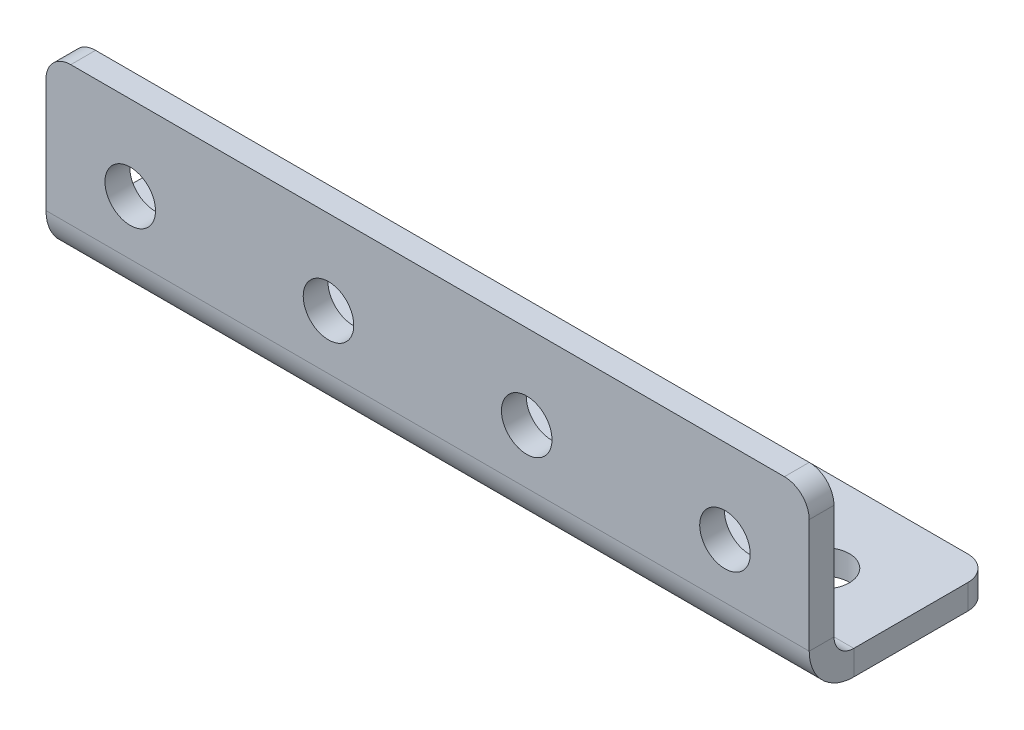
ISO-10303-21;
HEADER;
FILE_DESCRIPTION(('STEP AP214'),'2;1');
FILE_NAME('part.step','',(''),(''),'','','');
FILE_SCHEMA(('AUTOMOTIVE_DESIGN { 1 0 10303 214 1 1 1 1 }'));
ENDSEC;
DATA;
#1=APPLICATION_CONTEXT('core data for automotive mechanical design processes');
#2=APPLICATION_PROTOCOL_DEFINITION('international standard','automotive_design',2000,#1);
#3=PRODUCT_CONTEXT('',#1,'mechanical');
#4=PRODUCT('Part','Part','',(#3));
#5=PRODUCT_RELATED_PRODUCT_CATEGORY('part','',(#4));
#6=PRODUCT_DEFINITION_FORMATION('','',#4);
#7=PRODUCT_DEFINITION_CONTEXT('part definition',#1,'design');
#8=PRODUCT_DEFINITION('design','',#6,#7);
#9=PRODUCT_DEFINITION_SHAPE('','',#8);
#10=(LENGTH_UNIT() NAMED_UNIT(*) SI_UNIT(.MILLI.,.METRE.));
#11=(NAMED_UNIT(*) PLANE_ANGLE_UNIT() SI_UNIT($,.RADIAN.));
#12=(NAMED_UNIT(*) SI_UNIT($,.STERADIAN.) SOLID_ANGLE_UNIT());
#13=UNCERTAINTY_MEASURE_WITH_UNIT(LENGTH_MEASURE(1.E-05),#10,'distance_accuracy_value','');
#14=(GEOMETRIC_REPRESENTATION_CONTEXT(3) GLOBAL_UNCERTAINTY_ASSIGNED_CONTEXT((#13)) GLOBAL_UNIT_ASSIGNED_CONTEXT((#10,
#11,#12)) REPRESENTATION_CONTEXT('',''));
#15=CARTESIAN_POINT('',(0.,0.,0.));
#16=DIRECTION('',(0.,0.,1.));
#17=DIRECTION('',(1.,0.,0.));
#18=AXIS2_PLACEMENT_3D('',#15,#16,#17);
#19=CARTESIAN_POINT('',(37.9676188474614,-3.23523101769615,8.26785834254042));
#20=DIRECTION('',(1.,0.,0.));
#21=DIRECTION('',(0.,0.,-1.));
#22=AXIS2_PLACEMENT_3D('',#19,#20,#21);
#23=PLANE('',#22);
#24=DIRECTION('',(0.,0.,-1.));
#25=VECTOR('',#24,1.);
#26=CARTESIAN_POINT('',(37.9676188474614,-3.23523101769615,8.26785834254042));
#27=LINE('',#26,#25);
#28=CARTESIAN_POINT('',(37.9676188474614,-3.23523101769615,8.26785834254042));
#29=VERTEX_POINT('',#28);
#30=CARTESIAN_POINT('',(37.9676188474614,-3.23523101769615,5.76785834254042));
#31=VERTEX_POINT('',#30);
#32=EDGE_CURVE('E117',#29,#31,#27,.T.);
#33=ORIENTED_EDGE('',*,*,#32,.F.);
#34=CARTESIAN_POINT('',(37.9676188474614,-3.23523101769615,3.76785834254042));
#35=DIRECTION('',(-1.,0.,0.));
#36=DIRECTION('',(0.,0.,1.));
#37=AXIS2_PLACEMENT_3D('',#34,#35,#36);
#38=CIRCLE('',#37,4.5);
#39=CARTESIAN_POINT('',(37.9676188474614,-7.73523101769615,3.76785834254042));
#40=VERTEX_POINT('',#39);
#41=EDGE_CURVE('E115',#29,#40,#38,.F.);
#42=ORIENTED_EDGE('',*,*,#41,.T.);
#43=DIRECTION('',(0.,-1.,0.));
#44=VECTOR('',#43,1.);
#45=CARTESIAN_POINT('',(37.9676188474614,-5.23523101769615,3.76785834254042));
#46=LINE('',#45,#44);
#47=CARTESIAN_POINT('',(37.9676188474614,-5.23523101769615,3.76785834254042));
#48=VERTEX_POINT('',#47);
#49=EDGE_CURVE('E109',#48,#40,#46,.T.);
#50=ORIENTED_EDGE('',*,*,#49,.F.);
#51=CARTESIAN_POINT('',(37.9676188474614,-3.23523101769615,3.76785834254042));
#52=DIRECTION('',(1.,0.,0.));
#53=DIRECTION('',(0.,0.,-1.));
#54=AXIS2_PLACEMENT_3D('',#51,#52,#53);
#55=CIRCLE('',#54,2.);
#56=EDGE_CURVE('E113',#31,#48,#55,.T.);
#57=ORIENTED_EDGE('',*,*,#56,.F.);
#58=EDGE_LOOP('',(#33,#42,#50,#57));
#59=FACE_BOUND('',#58,.T.);
#60=ADVANCED_FACE('F16',(#59),#23,.T.);
#61=CARTESIAN_POINT('',(37.9676188474614,-5.23523101769615,3.76785834254042));
#62=DIRECTION('',(1.,0.,0.));
#63=DIRECTION('',(0.,0.,-1.));
#64=AXIS2_PLACEMENT_3D('',#61,#62,#63);
#65=PLANE('',#64);
#66=DIRECTION('',(0.,1.,0.));
#67=VECTOR('',#66,1.);
#68=CARTESIAN_POINT('',(37.9676188474614,-7.73523101769615,5.76785834254042));
#69=LINE('',#68,#67);
#70=CARTESIAN_POINT('',(37.9676188474614,8.26476898230385,5.76785834254042));
#71=VERTEX_POINT('',#70);
#72=EDGE_CURVE('E141',#71,#31,#69,.F.);
#73=ORIENTED_EDGE('',*,*,#72,.F.);
#74=DIRECTION('',(0.,0.,-1.));
#75=VECTOR('',#74,1.);
#76=CARTESIAN_POINT('',(37.9676188474614,8.26476898230385,3.76785834254042));
#77=LINE('',#76,#75);
#78=CARTESIAN_POINT('',(37.9676188474614,8.26476898230385,8.26785834254042));
#79=VERTEX_POINT('',#78);
#80=EDGE_CURVE('E194',#71,#79,#77,.F.);
#81=ORIENTED_EDGE('',*,*,#80,.T.);
#82=DIRECTION('',(0.,-1.,0.));
#83=VECTOR('',#82,1.);
#84=CARTESIAN_POINT('',(37.9676188474614,-7.73523101769615,8.26785834254042));
#85=LINE('',#84,#83);
#86=EDGE_CURVE('E143',#79,#29,#85,.T.);
#87=ORIENTED_EDGE('',*,*,#86,.T.);
#88=ORIENTED_EDGE('',*,*,#32,.T.);
#89=EDGE_LOOP('',(#73,#81,#87,#88));
#90=FACE_BOUND('',#89,.T.);
#91=ADVANCED_FACE('F251',(#90),#65,.T.);
#92=CARTESIAN_POINT('',(-39.0323811525386,-7.73523101769615,3.76785834254042));
#93=DIRECTION('',(-1.,0.,0.));
#94=DIRECTION('',(0.,0.,1.));
#95=AXIS2_PLACEMENT_3D('',#92,#93,#94);
#96=PLANE('',#95);
#97=DIRECTION('',(0.,1.,0.));
#98=VECTOR('',#97,1.);
#99=CARTESIAN_POINT('',(-39.0323811525386,-7.73523101769615,3.76785834254042));
#100=LINE('',#99,#98);
#101=CARTESIAN_POINT('',(-39.0323811525386,-7.73523101769615,3.76785834254042));
#102=VERTEX_POINT('',#101);
#103=CARTESIAN_POINT('',(-39.0323811525386,-5.23523101769615,3.76785834254042));
#104=VERTEX_POINT('',#103);
#105=EDGE_CURVE('E118',#102,#104,#100,.T.);
#106=ORIENTED_EDGE('',*,*,#105,.F.);
#107=CARTESIAN_POINT('',(-39.0323811525386,-3.23523101769615,3.76785834254042));
#108=DIRECTION('',(-1.,0.,0.));
#109=DIRECTION('',(0.,0.,1.));
#110=AXIS2_PLACEMENT_3D('',#107,#108,#109);
#111=CIRCLE('',#110,4.5);
#112=CARTESIAN_POINT('',(-39.0323811525386,-3.23523101769615,8.26785834254042));
#113=VERTEX_POINT('',#112);
#114=EDGE_CURVE('E161',#113,#102,#111,.F.);
#115=ORIENTED_EDGE('',*,*,#114,.F.);
#116=DIRECTION('',(0.,0.,1.));
#117=VECTOR('',#116,1.);
#118=CARTESIAN_POINT('',(-39.0323811525386,-3.23523101769615,5.76785834254042));
#119=LINE('',#118,#117);
#120=CARTESIAN_POINT('',(-39.0323811525386,-3.23523101769615,5.76785834254042));
#121=VERTEX_POINT('',#120);
#122=EDGE_CURVE('E179',#121,#113,#119,.T.);
#123=ORIENTED_EDGE('',*,*,#122,.F.);
#124=CARTESIAN_POINT('',(-39.0323811525386,-3.23523101769615,3.76785834254042));
#125=DIRECTION('',(1.,0.,0.));
#126=DIRECTION('',(0.,0.,-1.));
#127=AXIS2_PLACEMENT_3D('',#124,#125,#126);
#128=CIRCLE('',#127,2.);
#129=EDGE_CURVE('E155',#121,#104,#128,.T.);
#130=ORIENTED_EDGE('',*,*,#129,.T.);
#131=EDGE_LOOP('',(#106,#115,#123,#130));
#132=FACE_BOUND('',#131,.T.);
#133=ADVANCED_FACE('F256',(#132),#96,.T.);
#134=CARTESIAN_POINT('',(-39.0323811525386,-3.23523101769615,5.76785834254042));
#135=DIRECTION('',(-1.,0.,0.));
#136=DIRECTION('',(0.,0.,1.));
#137=AXIS2_PLACEMENT_3D('',#134,#135,#136);
#138=PLANE('',#137);
#139=DIRECTION('',(0.,0.,-1.));
#140=VECTOR('',#139,1.);
#141=CARTESIAN_POINT('',(-39.0323811525386,-5.23523101769615,8.26785834254042));
#142=LINE('',#141,#140);
#143=CARTESIAN_POINT('',(-39.0323811525386,-5.23523101769615,-7.73214165745958));
#144=VERTEX_POINT('',#143);
#145=EDGE_CURVE('E128',#104,#144,#142,.T.);
#146=ORIENTED_EDGE('',*,*,#145,.T.);
#147=DIRECTION('',(0.,-1.,0.));
#148=VECTOR('',#147,1.);
#149=CARTESIAN_POINT('',(-39.0323811525386,-3.23523101769615,-7.73214165745958));
#150=LINE('',#149,#148);
#151=CARTESIAN_POINT('',(-39.0323811525386,-7.73523101769615,-7.73214165745958));
#152=VERTEX_POINT('',#151);
#153=EDGE_CURVE('E203',#144,#152,#150,.T.);
#154=ORIENTED_EDGE('',*,*,#153,.T.);
#155=DIRECTION('',(0.,0.,-1.));
#156=VECTOR('',#155,1.);
#157=CARTESIAN_POINT('',(-39.0323811525386,-7.73523101769615,8.26785834254042));
#158=LINE('',#157,#156);
#159=EDGE_CURVE('E150',#102,#152,#158,.T.);
#160=ORIENTED_EDGE('',*,*,#159,.F.);
#161=ORIENTED_EDGE('',*,*,#105,.T.);
#162=EDGE_LOOP('',(#146,#154,#160,#161));
#163=FACE_BOUND('',#162,.T.);
#164=ADVANCED_FACE('F375',(#163),#138,.T.);
#165=CARTESIAN_POINT('',(37.9676188474614,-7.73523101769615,8.26785834254042));
#166=DIRECTION('',(0.,1.,0.));
#167=DIRECTION('',(0.,0.,1.));
#168=AXIS2_PLACEMENT_3D('',#165,#166,#167);
#169=PLANE('',#168);
#170=CARTESIAN_POINT('',(29.4676188474614,-7.73523101769615,-1.73214165745958));
#171=DIRECTION('',(0.,1.,0.));
#172=DIRECTION('',(0.,0.,1.));
#173=AXIS2_PLACEMENT_3D('',#170,#171,#172);
#174=CIRCLE('',#173,2.55);
#175=CARTESIAN_POINT('',(29.4676188474614,-7.73523101769615,0.817858342540421));
#176=VERTEX_POINT('',#175);
#177=EDGE_CURVE('E330',#176,#176,#174,.T.);
#178=ORIENTED_EDGE('',*,*,#177,.T.);
#179=EDGE_LOOP('',(#178));
#180=FACE_BOUND('',#179,.T.);
#181=CARTESIAN_POINT('',(9.46761884746138,-7.73523101769615,-1.73214165745958));
#182=DIRECTION('',(0.,1.,0.));
#183=DIRECTION('',(0.,0.,1.));
#184=AXIS2_PLACEMENT_3D('',#181,#182,#183);
#185=CIRCLE('',#184,2.55);
#186=CARTESIAN_POINT('',(9.46761884746138,-7.73523101769615,0.817858342540421));
#187=VERTEX_POINT('',#186);
#188=EDGE_CURVE('E339',#187,#187,#185,.T.);
#189=ORIENTED_EDGE('',*,*,#188,.T.);
#190=EDGE_LOOP('',(#189));
#191=FACE_BOUND('',#190,.T.);
#192=CARTESIAN_POINT('',(-10.5323811525386,-7.73523101769615,-1.73214165745958));
#193=DIRECTION('',(0.,1.,0.));
#194=DIRECTION('',(0.,0.,1.));
#195=AXIS2_PLACEMENT_3D('',#192,#193,#194);
#196=CIRCLE('',#195,2.55);
#197=CARTESIAN_POINT('',(-10.5323811525386,-7.73523101769615,0.817858342540421));
#198=VERTEX_POINT('',#197);
#199=EDGE_CURVE('E345',#198,#198,#196,.T.);
#200=ORIENTED_EDGE('',*,*,#199,.T.);
#201=EDGE_LOOP('',(#200));
#202=FACE_BOUND('',#201,.T.);
#203=CARTESIAN_POINT('',(-30.5323811525386,-7.73523101769615,-1.73214165745958));
#204=DIRECTION('',(0.,1.,0.));
#205=DIRECTION('',(0.,0.,1.));
#206=AXIS2_PLACEMENT_3D('',#203,#204,#205);
#207=CIRCLE('',#206,2.55);
#208=CARTESIAN_POINT('',(-30.5323811525386,-7.73523101769615,0.817858342540421));
#209=VERTEX_POINT('',#208);
#210=EDGE_CURVE('E356',#209,#209,#207,.T.);
#211=ORIENTED_EDGE('',*,*,#210,.T.);
#212=EDGE_LOOP('',(#211));
#213=FACE_BOUND('',#212,.T.);
#214=ORIENTED_EDGE('',*,*,#159,.T.);
#215=CARTESIAN_POINT('',(-36.5323811525386,-7.73523101769615,-7.73214165745958));
#216=DIRECTION('',(0.,1.,0.));
#217=DIRECTION('',(0.,0.,1.));
#218=AXIS2_PLACEMENT_3D('',#215,#216,#217);
#219=CIRCLE('',#218,2.5);
#220=CARTESIAN_POINT('',(-36.5323811525386,-7.73523101769615,-10.2321416574596));
#221=VERTEX_POINT('',#220);
#222=EDGE_CURVE('E208',#152,#221,#219,.F.);
#223=ORIENTED_EDGE('',*,*,#222,.T.);
#224=DIRECTION('',(-1.,0.,0.));
#225=VECTOR('',#224,1.);
#226=CARTESIAN_POINT('',(37.9676188474614,-7.73523101769615,-10.2321416574596));
#227=LINE('',#226,#225);
#228=CARTESIAN_POINT('',(35.4676188474614,-7.73523101769615,-10.2321416574596));
#229=VERTEX_POINT('',#228);
#230=EDGE_CURVE('E177',#229,#221,#227,.T.);
#231=ORIENTED_EDGE('',*,*,#230,.F.);
#232=CARTESIAN_POINT('',(35.4676188474614,-7.73523101769615,-7.73214165745958));
#233=DIRECTION('',(0.,1.,0.));
#234=DIRECTION('',(0.,0.,1.));
#235=AXIS2_PLACEMENT_3D('',#232,#233,#234);
#236=CIRCLE('',#235,2.5);
#237=CARTESIAN_POINT('',(37.9676188474614,-7.73523101769615,-7.73214165745958));
#238=VERTEX_POINT('',#237);
#239=EDGE_CURVE('E206',#229,#238,#236,.F.);
#240=ORIENTED_EDGE('',*,*,#239,.T.);
#241=DIRECTION('',(0.,0.,-1.));
#242=VECTOR('',#241,1.);
#243=CARTESIAN_POINT('',(37.9676188474614,-7.73523101769615,8.26785834254042));
#244=LINE('',#243,#242);
#245=EDGE_CURVE('E136',#40,#238,#244,.T.);
#246=ORIENTED_EDGE('',*,*,#245,.F.);
#247=DIRECTION('',(-1.,0.,0.));
#248=VECTOR('',#247,1.);
#249=CARTESIAN_POINT('',(37.9676188474614,-7.73523101769615,3.76785834254042));
#250=LINE('',#249,#248);
#251=EDGE_CURVE('E149',#40,#102,#250,.T.);
#252=ORIENTED_EDGE('',*,*,#251,.T.);
#253=EDGE_LOOP('',(#214,#223,#231,#240,#246,#252));
#254=FACE_BOUND('',#253,.T.);
#255=ADVANCED_FACE('F371',(#180,#191,#202,#213,#254),#169,.F.);
#256=CARTESIAN_POINT('',(37.9676188474614,-5.23523101769615,-10.2321416574596));
#257=DIRECTION('',(0.,0.,-1.));
#258=DIRECTION('',(-1.,0.,0.));
#259=AXIS2_PLACEMENT_3D('',#256,#257,#258);
#260=PLANE('',#259);
#261=ORIENTED_EDGE('',*,*,#230,.T.);
#262=DIRECTION('',(0.,-1.,0.));
#263=VECTOR('',#262,1.);
#264=CARTESIAN_POINT('',(-36.5323811525386,-5.23523101769615,-10.2321416574596));
#265=LINE('',#264,#263);
#266=CARTESIAN_POINT('',(-36.5323811525386,-5.23523101769615,-10.2321416574596));
#267=VERTEX_POINT('',#266);
#268=EDGE_CURVE('E39',#221,#267,#265,.F.);
#269=ORIENTED_EDGE('',*,*,#268,.T.);
#270=DIRECTION('',(-1.,0.,0.));
#271=VECTOR('',#270,1.);
#272=CARTESIAN_POINT('',(37.9676188474614,-5.23523101769615,-10.2321416574596));
#273=LINE('',#272,#271);
#274=CARTESIAN_POINT('',(35.4676188474614,-5.23523101769615,-10.2321416574596));
#275=VERTEX_POINT('',#274);
#276=EDGE_CURVE('E132',#275,#267,#273,.T.);
#277=ORIENTED_EDGE('',*,*,#276,.F.);
#278=DIRECTION('',(0.,-1.,0.));
#279=VECTOR('',#278,1.);
#280=CARTESIAN_POINT('',(35.4676188474614,-5.23523101769615,-10.2321416574596));
#281=LINE('',#280,#279);
#282=EDGE_CURVE('E210',#275,#229,#281,.T.);
#283=ORIENTED_EDGE('',*,*,#282,.T.);
#284=EDGE_LOOP('',(#261,#269,#277,#283));
#285=FACE_BOUND('',#284,.T.);
#286=ADVANCED_FACE('F369',(#285),#260,.T.);
#287=CARTESIAN_POINT('',(37.9676188474614,-5.23523101769615,8.26785834254042));
#288=DIRECTION('',(0.,1.,0.));
#289=DIRECTION('',(0.,0.,1.));
#290=AXIS2_PLACEMENT_3D('',#287,#288,#289);
#291=PLANE('',#290);
#292=CARTESIAN_POINT('',(29.4676188474614,-5.23523101769615,-1.73214165745958));
#293=DIRECTION('',(0.,1.,0.));
#294=DIRECTION('',(0.,0.,1.));
#295=AXIS2_PLACEMENT_3D('',#292,#293,#294);
#296=CIRCLE('',#295,2.55);
#297=CARTESIAN_POINT('',(29.4676188474614,-5.23523101769615,0.817858342540421));
#298=VERTEX_POINT('',#297);
#299=EDGE_CURVE('E333',#298,#298,#296,.T.);
#300=ORIENTED_EDGE('',*,*,#299,.F.);
#301=EDGE_LOOP('',(#300));
#302=FACE_BOUND('',#301,.T.);
#303=CARTESIAN_POINT('',(9.46761884746138,-5.23523101769615,-1.73214165745958));
#304=DIRECTION('',(0.,1.,0.));
#305=DIRECTION('',(0.,0.,1.));
#306=AXIS2_PLACEMENT_3D('',#303,#304,#305);
#307=CIRCLE('',#306,2.55);
#308=CARTESIAN_POINT('',(9.46761884746138,-5.23523101769615,0.817858342540421));
#309=VERTEX_POINT('',#308);
#310=EDGE_CURVE('E336',#309,#309,#307,.T.);
#311=ORIENTED_EDGE('',*,*,#310,.F.);
#312=EDGE_LOOP('',(#311));
#313=FACE_BOUND('',#312,.T.);
#314=CARTESIAN_POINT('',(-10.5323811525386,-5.23523101769615,-1.73214165745958));
#315=DIRECTION('',(0.,1.,0.));
#316=DIRECTION('',(0.,0.,1.));
#317=AXIS2_PLACEMENT_3D('',#314,#315,#316);
#318=CIRCLE('',#317,2.55);
#319=CARTESIAN_POINT('',(-10.5323811525386,-5.23523101769615,0.817858342540421));
#320=VERTEX_POINT('',#319);
#321=EDGE_CURVE('E342',#320,#320,#318,.T.);
#322=ORIENTED_EDGE('',*,*,#321,.F.);
#323=EDGE_LOOP('',(#322));
#324=FACE_BOUND('',#323,.T.);
#325=CARTESIAN_POINT('',(-30.5323811525386,-5.23523101769615,-1.73214165745958));
#326=DIRECTION('',(0.,1.,0.));
#327=DIRECTION('',(0.,0.,1.));
#328=AXIS2_PLACEMENT_3D('',#325,#326,#327);
#329=CIRCLE('',#328,2.55);
#330=CARTESIAN_POINT('',(-30.5323811525386,-5.23523101769615,0.817858342540421));
#331=VERTEX_POINT('',#330);
#332=EDGE_CURVE('E355',#331,#331,#329,.T.);
#333=ORIENTED_EDGE('',*,*,#332,.F.);
#334=EDGE_LOOP('',(#333));
#335=FACE_BOUND('',#334,.T.);
#336=ORIENTED_EDGE('',*,*,#276,.T.);
#337=CARTESIAN_POINT('',(-36.5323811525386,-5.23523101769615,-7.73214165745958));
#338=DIRECTION('',(0.,1.,0.));
#339=DIRECTION('',(0.,0.,1.));
#340=AXIS2_PLACEMENT_3D('',#337,#338,#339);
#341=CIRCLE('',#340,2.5);
#342=EDGE_CURVE('E216',#267,#144,#341,.T.);
#343=ORIENTED_EDGE('',*,*,#342,.T.);
#344=ORIENTED_EDGE('',*,*,#145,.F.);
#345=DIRECTION('',(-1.,0.,0.));
#346=VECTOR('',#345,1.);
#347=CARTESIAN_POINT('',(37.9676188474614,-5.23523101769615,3.76785834254042));
#348=LINE('',#347,#346);
#349=EDGE_CURVE('E123',#48,#104,#348,.T.);
#350=ORIENTED_EDGE('',*,*,#349,.F.);
#351=DIRECTION('',(0.,0.,-1.));
#352=VECTOR('',#351,1.);
#353=CARTESIAN_POINT('',(37.9676188474614,-5.23523101769615,8.26785834254042));
#354=LINE('',#353,#352);
#355=CARTESIAN_POINT('',(37.9676188474614,-5.23523101769615,-7.73214165745958));
#356=VERTEX_POINT('',#355);
#357=EDGE_CURVE('E125',#48,#356,#354,.T.);
#358=ORIENTED_EDGE('',*,*,#357,.T.);
#359=CARTESIAN_POINT('',(35.4676188474614,-5.23523101769615,-7.73214165745958));
#360=DIRECTION('',(0.,1.,0.));
#361=DIRECTION('',(0.,0.,1.));
#362=AXIS2_PLACEMENT_3D('',#359,#360,#361);
#363=CIRCLE('',#362,2.5);
#364=EDGE_CURVE('E214',#356,#275,#363,.T.);
#365=ORIENTED_EDGE('',*,*,#364,.T.);
#366=EDGE_LOOP('',(#336,#343,#344,#350,#358,#365));
#367=FACE_BOUND('',#366,.T.);
#368=ADVANCED_FACE('F124',(#302,#313,#324,#335,#367),#291,.T.);
#369=CARTESIAN_POINT('',(37.9676188474614,-3.23523101769615,3.76785834254042));
#370=DIRECTION('',(-1.,0.,0.));
#371=DIRECTION('',(0.,0.,1.));
#372=AXIS2_PLACEMENT_3D('',#369,#370,#371);
#373=CYLINDRICAL_SURFACE('',#372,2.);
#374=ORIENTED_EDGE('',*,*,#129,.F.);
#375=DIRECTION('',(-1.,0.,0.));
#376=VECTOR('',#375,1.);
#377=CARTESIAN_POINT('',(37.9676188474614,-3.23523101769615,5.76785834254042));
#378=LINE('',#377,#376);
#379=EDGE_CURVE('E133',#31,#121,#378,.T.);
#380=ORIENTED_EDGE('',*,*,#379,.F.);
#381=ORIENTED_EDGE('',*,*,#56,.T.);
#382=ORIENTED_EDGE('',*,*,#349,.T.);
#383=EDGE_LOOP('',(#374,#380,#381,#382));
#384=FACE_BOUND('',#383,.T.);
#385=ADVANCED_FACE('F139',(#384),#373,.F.);
#386=CARTESIAN_POINT('',(37.9676188474614,-7.73523101769615,5.76785834254042));
#387=DIRECTION('',(0.,0.,-1.));
#388=DIRECTION('',(-1.,0.,0.));
#389=AXIS2_PLACEMENT_3D('',#386,#387,#388);
#390=PLANE('',#389);
#391=CARTESIAN_POINT('',(-10.5323811525386,2.26476898230385,5.76785834254042));
#392=DIRECTION('',(0.,0.,-1.));
#393=DIRECTION('',(-1.,0.,0.));
#394=AXIS2_PLACEMENT_3D('',#391,#392,#393);
#395=CIRCLE('',#394,2.55);
#396=CARTESIAN_POINT('',(-13.0823811525386,2.26476898230385,5.76785834254042));
#397=VERTEX_POINT('',#396);
#398=EDGE_CURVE('E352',#397,#397,#395,.T.);
#399=ORIENTED_EDGE('',*,*,#398,.F.);
#400=EDGE_LOOP('',(#399));
#401=FACE_BOUND('',#400,.T.);
#402=CARTESIAN_POINT('',(-30.5323811525386,2.26476898230385,5.76785834254042));
#403=DIRECTION('',(0.,0.,-1.));
#404=DIRECTION('',(-1.,0.,0.));
#405=AXIS2_PLACEMENT_3D('',#402,#403,#404);
#406=CIRCLE('',#405,2.55);
#407=CARTESIAN_POINT('',(-33.0823811525386,2.26476898230385,5.76785834254042));
#408=VERTEX_POINT('',#407);
#409=EDGE_CURVE('E359',#408,#408,#406,.T.);
#410=ORIENTED_EDGE('',*,*,#409,.F.);
#411=EDGE_LOOP('',(#410));
#412=FACE_BOUND('',#411,.T.);
#413=DIRECTION('',(-1.,0.,0.));
#414=VECTOR('',#413,1.);
#415=CARTESIAN_POINT('',(37.9676188474614,10.7647689823038,5.76785834254042));
#416=LINE('',#415,#414);
#417=CARTESIAN_POINT('',(35.4676188474614,10.7647689823038,5.76785834254042));
#418=VERTEX_POINT('',#417);
#419=CARTESIAN_POINT('',(-36.5323811525386,10.7647689823038,5.76785834254042));
#420=VERTEX_POINT('',#419);
#421=EDGE_CURVE('E172',#418,#420,#416,.T.);
#422=ORIENTED_EDGE('',*,*,#421,.F.);
#423=CARTESIAN_POINT('',(35.4676188474614,8.26476898230385,5.76785834254042));
#424=DIRECTION('',(0.,0.,-1.));
#425=DIRECTION('',(-1.,0.,0.));
#426=AXIS2_PLACEMENT_3D('',#423,#424,#425);
#427=CIRCLE('',#426,2.5);
#428=EDGE_CURVE('E192',#418,#71,#427,.T.);
#429=ORIENTED_EDGE('',*,*,#428,.T.);
#430=ORIENTED_EDGE('',*,*,#72,.T.);
#431=ORIENTED_EDGE('',*,*,#379,.T.);
#432=DIRECTION('',(0.,1.,0.));
#433=VECTOR('',#432,1.);
#434=CARTESIAN_POINT('',(-39.0323811525386,-7.73523101769615,5.76785834254042));
#435=LINE('',#434,#433);
#436=CARTESIAN_POINT('',(-39.0323811525386,8.26476898230385,5.76785834254042));
#437=VERTEX_POINT('',#436);
#438=EDGE_CURVE('E157',#437,#121,#435,.F.);
#439=ORIENTED_EDGE('',*,*,#438,.F.);
#440=CARTESIAN_POINT('',(-36.5323811525386,8.26476898230385,5.76785834254042));
#441=DIRECTION('',(0.,0.,-1.));
#442=DIRECTION('',(-1.,0.,0.));
#443=AXIS2_PLACEMENT_3D('',#440,#441,#442);
#444=CIRCLE('',#443,2.5);
#445=EDGE_CURVE('E190',#437,#420,#444,.T.);
#446=ORIENTED_EDGE('',*,*,#445,.T.);
#447=EDGE_LOOP('',(#422,#429,#430,#431,#439,#446));
#448=FACE_BOUND('',#447,.T.);
#449=CARTESIAN_POINT('',(9.46761884746138,2.26476898230385,5.76785834254042));
#450=DIRECTION('',(0.,0.,-1.));
#451=DIRECTION('',(-1.,0.,0.));
#452=AXIS2_PLACEMENT_3D('',#449,#450,#451);
#453=CIRCLE('',#452,2.55);
#454=CARTESIAN_POINT('',(6.91761884746138,2.26476898230385,5.76785834254042));
#455=VERTEX_POINT('',#454);
#456=EDGE_CURVE('E222',#455,#455,#453,.T.);
#457=ORIENTED_EDGE('',*,*,#456,.F.);
#458=EDGE_LOOP('',(#457));
#459=FACE_BOUND('',#458,.T.);
#460=CARTESIAN_POINT('',(29.4676188474614,2.26476898230385,5.76785834254042));
#461=DIRECTION('',(0.,0.,-1.));
#462=DIRECTION('',(-1.,0.,0.));
#463=AXIS2_PLACEMENT_3D('',#460,#461,#462);
#464=CIRCLE('',#463,2.55);
#465=CARTESIAN_POINT('',(26.9176188474614,2.26476898230385,5.76785834254042));
#466=VERTEX_POINT('',#465);
#467=EDGE_CURVE('E10',#466,#466,#464,.T.);
#468=ORIENTED_EDGE('',*,*,#467,.F.);
#469=EDGE_LOOP('',(#468));
#470=FACE_BOUND('',#469,.T.);
#471=ADVANCED_FACE('F235',(#401,#412,#448,#459,#470),#390,.T.);
#472=CARTESIAN_POINT('',(37.9676188474614,10.7647689823038,8.26785834254042));
#473=DIRECTION('',(0.,1.,0.));
#474=DIRECTION('',(0.,0.,1.));
#475=AXIS2_PLACEMENT_3D('',#472,#473,#474);
#476=PLANE('',#475);
#477=DIRECTION('',(-1.,0.,0.));
#478=VECTOR('',#477,1.);
#479=CARTESIAN_POINT('',(37.9676188474614,10.7647689823038,8.26785834254042));
#480=LINE('',#479,#478);
#481=CARTESIAN_POINT('',(35.4676188474614,10.7647689823038,8.26785834254042));
#482=VERTEX_POINT('',#481);
#483=CARTESIAN_POINT('',(-36.5323811525386,10.7647689823038,8.26785834254042));
#484=VERTEX_POINT('',#483);
#485=EDGE_CURVE('E169',#482,#484,#480,.T.);
#486=ORIENTED_EDGE('',*,*,#485,.F.);
#487=DIRECTION('',(0.,0.,-1.));
#488=VECTOR('',#487,1.);
#489=CARTESIAN_POINT('',(35.4676188474614,10.7647689823038,8.26785834254042));
#490=LINE('',#489,#488);
#491=EDGE_CURVE('E187',#482,#418,#490,.T.);
#492=ORIENTED_EDGE('',*,*,#491,.T.);
#493=ORIENTED_EDGE('',*,*,#421,.T.);
#494=DIRECTION('',(0.,0.,-1.));
#495=VECTOR('',#494,1.);
#496=CARTESIAN_POINT('',(-36.5323811525386,10.7647689823038,8.26785834254042));
#497=LINE('',#496,#495);
#498=EDGE_CURVE('E185',#420,#484,#497,.F.);
#499=ORIENTED_EDGE('',*,*,#498,.T.);
#500=EDGE_LOOP('',(#486,#492,#493,#499));
#501=FACE_BOUND('',#500,.T.);
#502=ADVANCED_FACE('F237',(#501),#476,.T.);
#503=CARTESIAN_POINT('',(37.9676188474614,-7.73523101769615,8.26785834254042));
#504=DIRECTION('',(0.,0.,-1.));
#505=DIRECTION('',(-1.,0.,0.));
#506=AXIS2_PLACEMENT_3D('',#503,#504,#505);
#507=PLANE('',#506);
#508=CARTESIAN_POINT('',(-10.5323811525386,2.26476898230385,8.26785834254042));
#509=DIRECTION('',(0.,0.,-1.));
#510=DIRECTION('',(-1.,0.,0.));
#511=AXIS2_PLACEMENT_3D('',#508,#509,#510);
#512=CIRCLE('',#511,2.55);
#513=CARTESIAN_POINT('',(-13.0823811525386,2.26476898230385,8.26785834254042));
#514=VERTEX_POINT('',#513);
#515=EDGE_CURVE('E348',#514,#514,#512,.T.);
#516=ORIENTED_EDGE('',*,*,#515,.T.);
#517=EDGE_LOOP('',(#516));
#518=FACE_BOUND('',#517,.T.);
#519=CARTESIAN_POINT('',(-30.5323811525386,2.26476898230385,8.26785834254042));
#520=DIRECTION('',(0.,0.,-1.));
#521=DIRECTION('',(-1.,0.,0.));
#522=AXIS2_PLACEMENT_3D('',#519,#520,#521);
#523=CIRCLE('',#522,2.55);
#524=CARTESIAN_POINT('',(-33.0823811525386,2.26476898230385,8.26785834254042));
#525=VERTEX_POINT('',#524);
#526=EDGE_CURVE('E153',#525,#525,#523,.T.);
#527=ORIENTED_EDGE('',*,*,#526,.T.);
#528=EDGE_LOOP('',(#527));
#529=FACE_BOUND('',#528,.T.);
#530=ORIENTED_EDGE('',*,*,#86,.F.);
#531=CARTESIAN_POINT('',(35.4676188474614,8.26476898230385,8.26785834254042));
#532=DIRECTION('',(0.,0.,-1.));
#533=DIRECTION('',(-1.,0.,0.));
#534=AXIS2_PLACEMENT_3D('',#531,#532,#533);
#535=CIRCLE('',#534,2.5);
#536=EDGE_CURVE('E198',#79,#482,#535,.F.);
#537=ORIENTED_EDGE('',*,*,#536,.T.);
#538=ORIENTED_EDGE('',*,*,#485,.T.);
#539=CARTESIAN_POINT('',(-36.5323811525386,8.26476898230385,8.26785834254042));
#540=DIRECTION('',(0.,0.,-1.));
#541=DIRECTION('',(-1.,0.,0.));
#542=AXIS2_PLACEMENT_3D('',#539,#540,#541);
#543=CIRCLE('',#542,2.5);
#544=CARTESIAN_POINT('',(-39.0323811525386,8.26476898230385,8.26785834254042));
#545=VERTEX_POINT('',#544);
#546=EDGE_CURVE('E196',#484,#545,#543,.F.);
#547=ORIENTED_EDGE('',*,*,#546,.T.);
#548=DIRECTION('',(0.,-1.,0.));
#549=VECTOR('',#548,1.);
#550=CARTESIAN_POINT('',(-39.0323811525386,-7.73523101769615,8.26785834254042));
#551=LINE('',#550,#549);
#552=EDGE_CURVE('E159',#545,#113,#551,.T.);
#553=ORIENTED_EDGE('',*,*,#552,.T.);
#554=DIRECTION('',(-1.,0.,0.));
#555=VECTOR('',#554,1.);
#556=CARTESIAN_POINT('',(37.9676188474614,-3.23523101769615,8.26785834254042));
#557=LINE('',#556,#555);
#558=EDGE_CURVE('E166',#29,#113,#557,.T.);
#559=ORIENTED_EDGE('',*,*,#558,.F.);
#560=EDGE_LOOP('',(#530,#537,#538,#547,#553,#559));
#561=FACE_BOUND('',#560,.T.);
#562=CARTESIAN_POINT('',(9.46761884746138,2.26476898230385,8.26785834254042));
#563=DIRECTION('',(0.,0.,-1.));
#564=DIRECTION('',(-1.,0.,0.));
#565=AXIS2_PLACEMENT_3D('',#562,#563,#564);
#566=CIRCLE('',#565,2.55);
#567=CARTESIAN_POINT('',(6.91761884746138,2.26476898230385,8.26785834254042));
#568=VERTEX_POINT('',#567);
#569=EDGE_CURVE('E219',#568,#568,#566,.T.);
#570=ORIENTED_EDGE('',*,*,#569,.T.);
#571=EDGE_LOOP('',(#570));
#572=FACE_BOUND('',#571,.T.);
#573=CARTESIAN_POINT('',(29.4676188474614,2.26476898230385,8.26785834254042));
#574=DIRECTION('',(0.,0.,-1.));
#575=DIRECTION('',(-1.,0.,0.));
#576=AXIS2_PLACEMENT_3D('',#573,#574,#575);
#577=CIRCLE('',#576,2.55);
#578=CARTESIAN_POINT('',(26.9176188474614,2.26476898230385,8.26785834254042));
#579=VERTEX_POINT('',#578);
#580=EDGE_CURVE('E24',#579,#579,#577,.T.);
#581=ORIENTED_EDGE('',*,*,#580,.T.);
#582=EDGE_LOOP('',(#581));
#583=FACE_BOUND('',#582,.T.);
#584=ADVANCED_FACE('F227',(#518,#529,#561,#572,#583),#507,.F.);
#585=CARTESIAN_POINT('',(37.9676188474614,-3.23523101769615,3.76785834254042));
#586=DIRECTION('',(-1.,0.,0.));
#587=DIRECTION('',(0.,0.,1.));
#588=AXIS2_PLACEMENT_3D('',#585,#586,#587);
#589=CYLINDRICAL_SURFACE('',#588,4.5);
#590=ORIENTED_EDGE('',*,*,#114,.T.);
#591=ORIENTED_EDGE('',*,*,#251,.F.);
#592=ORIENTED_EDGE('',*,*,#41,.F.);
#593=ORIENTED_EDGE('',*,*,#558,.T.);
#594=EDGE_LOOP('',(#590,#591,#592,#593));
#595=FACE_BOUND('',#594,.T.);
#596=ADVANCED_FACE('F291',(#595),#589,.T.);
#597=CARTESIAN_POINT('',(37.9676188474614,-3.23523101769615,3.76785834254042));
#598=DIRECTION('',(1.,0.,0.));
#599=DIRECTION('',(0.,0.,-1.));
#600=AXIS2_PLACEMENT_3D('',#597,#598,#599);
#601=PLANE('',#600);
#602=ORIENTED_EDGE('',*,*,#245,.T.);
#603=DIRECTION('',(0.,-1.,0.));
#604=VECTOR('',#603,1.);
#605=CARTESIAN_POINT('',(37.9676188474614,-3.23523101769615,-7.73214165745958));
#606=LINE('',#605,#604);
#607=EDGE_CURVE('E31',#238,#356,#606,.F.);
#608=ORIENTED_EDGE('',*,*,#607,.T.);
#609=ORIENTED_EDGE('',*,*,#357,.F.);
#610=ORIENTED_EDGE('',*,*,#49,.T.);
#611=EDGE_LOOP('',(#602,#608,#609,#610));
#612=FACE_BOUND('',#611,.T.);
#613=ADVANCED_FACE('F135',(#612),#601,.T.);
#614=CARTESIAN_POINT('',(-39.0323811525386,-3.23523101769615,3.76785834254042));
#615=DIRECTION('',(1.,0.,0.));
#616=DIRECTION('',(0.,0.,-1.));
#617=AXIS2_PLACEMENT_3D('',#614,#615,#616);
#618=PLANE('',#617);
#619=ORIENTED_EDGE('',*,*,#552,.F.);
#620=DIRECTION('',(0.,0.,-1.));
#621=VECTOR('',#620,1.);
#622=CARTESIAN_POINT('',(-39.0323811525386,8.26476898230385,5.76785834254042));
#623=LINE('',#622,#621);
#624=EDGE_CURVE('E200',#545,#437,#623,.T.);
#625=ORIENTED_EDGE('',*,*,#624,.T.);
#626=ORIENTED_EDGE('',*,*,#438,.T.);
#627=ORIENTED_EDGE('',*,*,#122,.T.);
#628=EDGE_LOOP('',(#619,#625,#626,#627));
#629=FACE_BOUND('',#628,.T.);
#630=ADVANCED_FACE('F302',(#629),#618,.F.);
#631=CARTESIAN_POINT('',(-30.5323811525386,2.26476898230385,8.26785834254042));
#632=DIRECTION('',(0.,0.,-1.));
#633=DIRECTION('',(-1.,0.,0.));
#634=AXIS2_PLACEMENT_3D('',#631,#632,#633);
#635=CYLINDRICAL_SURFACE('',#634,2.55);
#636=ORIENTED_EDGE('',*,*,#526,.F.);
#637=EDGE_LOOP('',(#636));
#638=FACE_BOUND('',#637,.T.);
#639=ORIENTED_EDGE('',*,*,#409,.T.);
#640=EDGE_LOOP('',(#639));
#641=FACE_BOUND('',#640,.T.);
#642=ADVANCED_FACE('F305',(#638,#641),#635,.F.);
#643=CARTESIAN_POINT('',(-30.5323811525386,-7.73523101769615,-1.73214165745958));
#644=DIRECTION('',(0.,1.,0.));
#645=DIRECTION('',(0.,0.,1.));
#646=AXIS2_PLACEMENT_3D('',#643,#644,#645);
#647=CYLINDRICAL_SURFACE('',#646,2.55);
#648=ORIENTED_EDGE('',*,*,#210,.F.);
#649=EDGE_LOOP('',(#648));
#650=FACE_BOUND('',#649,.T.);
#651=ORIENTED_EDGE('',*,*,#332,.T.);
#652=EDGE_LOOP('',(#651));
#653=FACE_BOUND('',#652,.T.);
#654=ADVANCED_FACE('F265',(#650,#653),#647,.F.);
#655=CARTESIAN_POINT('',(35.4676188474614,8.26476898230385,8.26785834254042));
#656=DIRECTION('',(0.,0.,-1.));
#657=DIRECTION('',(-1.,0.,0.));
#658=AXIS2_PLACEMENT_3D('',#655,#656,#657);
#659=CYLINDRICAL_SURFACE('',#658,2.5);
#660=ORIENTED_EDGE('',*,*,#536,.F.);
#661=ORIENTED_EDGE('',*,*,#80,.F.);
#662=ORIENTED_EDGE('',*,*,#428,.F.);
#663=ORIENTED_EDGE('',*,*,#491,.F.);
#664=EDGE_LOOP('',(#660,#661,#662,#663));
#665=FACE_BOUND('',#664,.T.);
#666=ADVANCED_FACE('F261',(#665),#659,.T.);
#667=CARTESIAN_POINT('',(-36.5323811525386,8.26476898230385,3.76785834254042));
#668=DIRECTION('',(0.,0.,1.));
#669=DIRECTION('',(1.,0.,0.));
#670=AXIS2_PLACEMENT_3D('',#667,#668,#669);
#671=CYLINDRICAL_SURFACE('',#670,2.5);
#672=ORIENTED_EDGE('',*,*,#546,.F.);
#673=ORIENTED_EDGE('',*,*,#498,.F.);
#674=ORIENTED_EDGE('',*,*,#445,.F.);
#675=ORIENTED_EDGE('',*,*,#624,.F.);
#676=EDGE_LOOP('',(#672,#673,#674,#675));
#677=FACE_BOUND('',#676,.T.);
#678=ADVANCED_FACE('F264',(#677),#671,.T.);
#679=CARTESIAN_POINT('',(-36.5323811525386,-3.23523101769615,-7.73214165745958));
#680=DIRECTION('',(0.,-1.,0.));
#681=DIRECTION('',(0.,0.,-1.));
#682=AXIS2_PLACEMENT_3D('',#679,#680,#681);
#683=CYLINDRICAL_SURFACE('',#682,2.5);
#684=ORIENTED_EDGE('',*,*,#342,.F.);
#685=ORIENTED_EDGE('',*,*,#268,.F.);
#686=ORIENTED_EDGE('',*,*,#222,.F.);
#687=ORIENTED_EDGE('',*,*,#153,.F.);
#688=EDGE_LOOP('',(#684,#685,#686,#687));
#689=FACE_BOUND('',#688,.T.);
#690=ADVANCED_FACE('F269',(#689),#683,.T.);
#691=CARTESIAN_POINT('',(35.4676188474614,-5.23523101769615,-7.73214165745958));
#692=DIRECTION('',(0.,-1.,0.));
#693=DIRECTION('',(0.,0.,-1.));
#694=AXIS2_PLACEMENT_3D('',#691,#692,#693);
#695=CYLINDRICAL_SURFACE('',#694,2.5);
#696=ORIENTED_EDGE('',*,*,#364,.F.);
#697=ORIENTED_EDGE('',*,*,#607,.F.);
#698=ORIENTED_EDGE('',*,*,#239,.F.);
#699=ORIENTED_EDGE('',*,*,#282,.F.);
#700=EDGE_LOOP('',(#696,#697,#698,#699));
#701=FACE_BOUND('',#700,.T.);
#702=ADVANCED_FACE('F273',(#701),#695,.T.);
#703=CARTESIAN_POINT('',(-10.5323811525386,2.26476898230385,8.26785834254042));
#704=DIRECTION('',(0.,0.,-1.));
#705=DIRECTION('',(-1.,0.,0.));
#706=AXIS2_PLACEMENT_3D('',#703,#704,#705);
#707=CYLINDRICAL_SURFACE('',#706,2.55);
#708=ORIENTED_EDGE('',*,*,#515,.F.);
#709=EDGE_LOOP('',(#708));
#710=FACE_BOUND('',#709,.T.);
#711=ORIENTED_EDGE('',*,*,#398,.T.);
#712=EDGE_LOOP('',(#711));
#713=FACE_BOUND('',#712,.T.);
#714=ADVANCED_FACE('F276',(#710,#713),#707,.F.);
#715=CARTESIAN_POINT('',(9.46761884746138,2.26476898230385,8.26785834254042));
#716=DIRECTION('',(0.,0.,-1.));
#717=DIRECTION('',(-1.,0.,0.));
#718=AXIS2_PLACEMENT_3D('',#715,#716,#717);
#719=CYLINDRICAL_SURFACE('',#718,2.55);
#720=ORIENTED_EDGE('',*,*,#569,.F.);
#721=EDGE_LOOP('',(#720));
#722=FACE_BOUND('',#721,.T.);
#723=ORIENTED_EDGE('',*,*,#456,.T.);
#724=EDGE_LOOP('',(#723));
#725=FACE_BOUND('',#724,.T.);
#726=ADVANCED_FACE('F232',(#722,#725),#719,.F.);
#727=CARTESIAN_POINT('',(29.4676188474614,2.26476898230385,8.26785834254042));
#728=DIRECTION('',(0.,0.,-1.));
#729=DIRECTION('',(-1.,0.,0.));
#730=AXIS2_PLACEMENT_3D('',#727,#728,#729);
#731=CYLINDRICAL_SURFACE('',#730,2.55);
#732=ORIENTED_EDGE('',*,*,#580,.F.);
#733=EDGE_LOOP('',(#732));
#734=FACE_BOUND('',#733,.T.);
#735=ORIENTED_EDGE('',*,*,#467,.T.);
#736=EDGE_LOOP('',(#735));
#737=FACE_BOUND('',#736,.T.);
#738=ADVANCED_FACE('F18',(#734,#737),#731,.F.);
#739=CARTESIAN_POINT('',(-10.5323811525386,-7.73523101769615,-1.73214165745958));
#740=DIRECTION('',(0.,1.,0.));
#741=DIRECTION('',(0.,0.,1.));
#742=AXIS2_PLACEMENT_3D('',#739,#740,#741);
#743=CYLINDRICAL_SURFACE('',#742,2.55);
#744=ORIENTED_EDGE('',*,*,#199,.F.);
#745=EDGE_LOOP('',(#744));
#746=FACE_BOUND('',#745,.T.);
#747=ORIENTED_EDGE('',*,*,#321,.T.);
#748=EDGE_LOOP('',(#747));
#749=FACE_BOUND('',#748,.T.);
#750=ADVANCED_FACE('F231',(#746,#749),#743,.F.);
#751=CARTESIAN_POINT('',(9.46761884746138,-7.73523101769615,-1.73214165745958));
#752=DIRECTION('',(0.,1.,0.));
#753=DIRECTION('',(0.,0.,1.));
#754=AXIS2_PLACEMENT_3D('',#751,#752,#753);
#755=CYLINDRICAL_SURFACE('',#754,2.55);
#756=ORIENTED_EDGE('',*,*,#188,.F.);
#757=EDGE_LOOP('',(#756));
#758=FACE_BOUND('',#757,.T.);
#759=ORIENTED_EDGE('',*,*,#310,.T.);
#760=EDGE_LOOP('',(#759));
#761=FACE_BOUND('',#760,.T.);
#762=ADVANCED_FACE('F317',(#758,#761),#755,.F.);
#763=CARTESIAN_POINT('',(29.4676188474614,-7.73523101769615,-1.73214165745958));
#764=DIRECTION('',(0.,1.,0.));
#765=DIRECTION('',(0.,0.,1.));
#766=AXIS2_PLACEMENT_3D('',#763,#764,#765);
#767=CYLINDRICAL_SURFACE('',#766,2.55);
#768=ORIENTED_EDGE('',*,*,#177,.F.);
#769=EDGE_LOOP('',(#768));
#770=FACE_BOUND('',#769,.T.);
#771=ORIENTED_EDGE('',*,*,#299,.T.);
#772=EDGE_LOOP('',(#771));
#773=FACE_BOUND('',#772,.T.);
#774=ADVANCED_FACE('F321',(#770,#773),#767,.F.);
#775=CLOSED_SHELL('',(#60,#91,#133,#164,#255,#286,#368,#385,#471,#502,#584,#596,#613,#630,#642,
#654,#666,#678,#690,#702,#714,#726,#738,#750,#762,#774));
#776=MANIFOLD_SOLID_BREP('B1',#775);
#777=ADVANCED_BREP_SHAPE_REPRESENTATION('',(#18,#776),#14);
#778=SHAPE_DEFINITION_REPRESENTATION(#9,#777);
ENDSEC;
END-ISO-10303-21;
